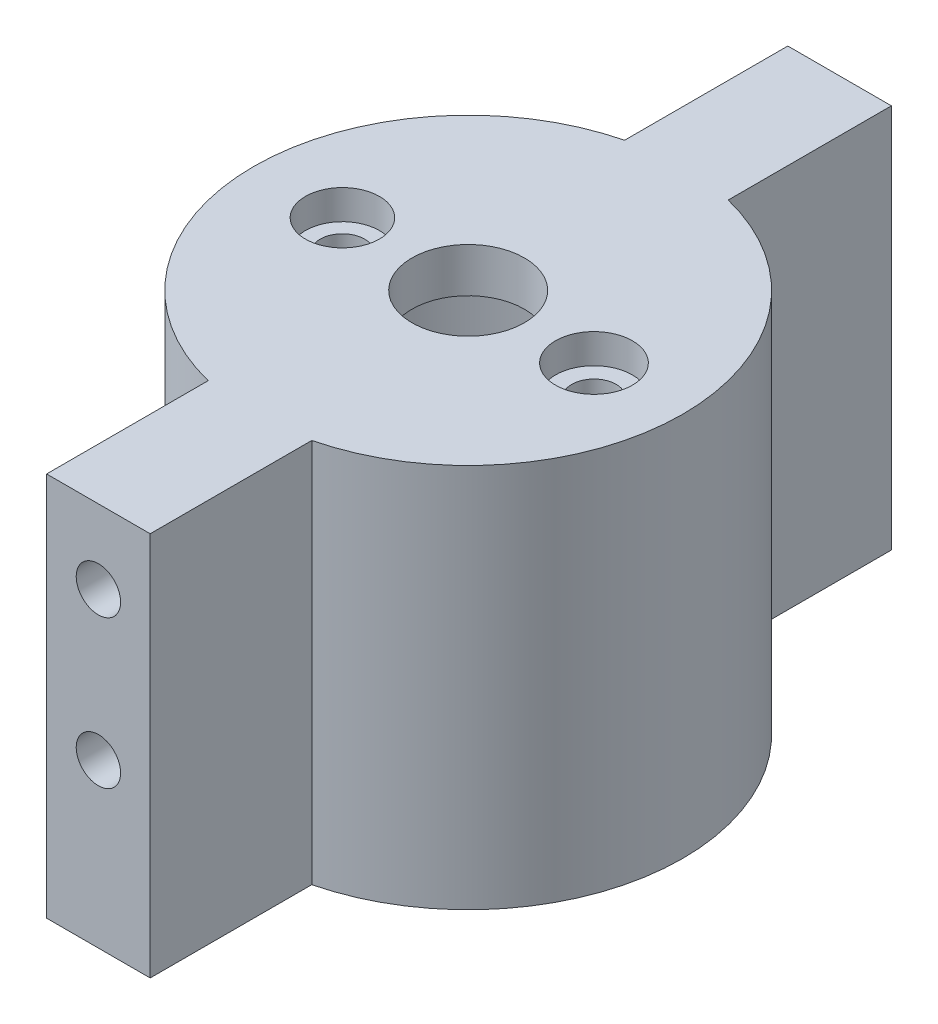
ISO-10303-21;
HEADER;
FILE_DESCRIPTION(('STEP AP214'),'2;1');
FILE_NAME('part.step','',(''),(''),'','','');
FILE_SCHEMA(('AUTOMOTIVE_DESIGN { 1 0 10303 214 1 1 1 1 }'));
ENDSEC;
DATA;
#1=APPLICATION_CONTEXT('core data for automotive mechanical design processes');
#2=APPLICATION_PROTOCOL_DEFINITION('international standard','automotive_design',2000,#1);
#3=PRODUCT_CONTEXT('',#1,'mechanical');
#4=PRODUCT('Part','Part','',(#3));
#5=PRODUCT_RELATED_PRODUCT_CATEGORY('part','',(#4));
#6=PRODUCT_DEFINITION_FORMATION('','',#4);
#7=PRODUCT_DEFINITION_CONTEXT('part definition',#1,'design');
#8=PRODUCT_DEFINITION('design','',#6,#7);
#9=PRODUCT_DEFINITION_SHAPE('','',#8);
#10=(LENGTH_UNIT() NAMED_UNIT(*) SI_UNIT(.MILLI.,.METRE.));
#11=(NAMED_UNIT(*) PLANE_ANGLE_UNIT() SI_UNIT($,.RADIAN.));
#12=(NAMED_UNIT(*) SI_UNIT($,.STERADIAN.) SOLID_ANGLE_UNIT());
#13=UNCERTAINTY_MEASURE_WITH_UNIT(LENGTH_MEASURE(1.E-05),#10,'distance_accuracy_value','');
#14=(GEOMETRIC_REPRESENTATION_CONTEXT(3) GLOBAL_UNCERTAINTY_ASSIGNED_CONTEXT((#13)) GLOBAL_UNIT_ASSIGNED_CONTEXT((#10,
#11,#12)) REPRESENTATION_CONTEXT('',''));
#15=CARTESIAN_POINT('',(0.,0.,0.));
#16=DIRECTION('',(0.,0.,1.));
#17=DIRECTION('',(1.,0.,0.));
#18=AXIS2_PLACEMENT_3D('',#15,#16,#17);
#19=CARTESIAN_POINT('',(0.,2.,0.));
#20=DIRECTION('',(0.,-1.,0.));
#21=DIRECTION('',(0.,0.,1.));
#22=AXIS2_PLACEMENT_3D('',#19,#20,#21);
#23=CYLINDRICAL_SURFACE('',#22,14.5);
#24=DIRECTION('',(0.,-1.,0.));
#25=VECTOR('',#24,1.);
#26=CARTESIAN_POINT('',(3.49999999999998,3.00000000000001,-14.0712472794703));
#27=LINE('',#26,#25);
#28=CARTESIAN_POINT('',(3.49999999999998,3.,-14.0712472794703));
#29=VERTEX_POINT('',#28);
#30=CARTESIAN_POINT('',(3.49999999999998,-23.,-14.0712472794703));
#31=VERTEX_POINT('',#30);
#32=EDGE_CURVE('E132',#29,#31,#27,.T.);
#33=ORIENTED_EDGE('',*,*,#32,.F.);
#34=CARTESIAN_POINT('',(0.,3.,0.));
#35=DIRECTION('',(0.,-1.,0.));
#36=DIRECTION('',(0.,0.,-1.));
#37=AXIS2_PLACEMENT_3D('',#34,#35,#36);
#38=CIRCLE('',#37,14.5);
#39=CARTESIAN_POINT('',(3.5,3.00000000000001,14.0712472794703));
#40=VERTEX_POINT('',#39);
#41=EDGE_CURVE('E138',#29,#40,#38,.T.);
#42=ORIENTED_EDGE('',*,*,#41,.T.);
#43=DIRECTION('',(0.,-1.,0.));
#44=VECTOR('',#43,1.);
#45=CARTESIAN_POINT('',(3.5,3.00000000000001,14.0712472794703));
#46=LINE('',#45,#44);
#47=CARTESIAN_POINT('',(3.5,-23.,14.0712472794703));
#48=VERTEX_POINT('',#47);
#49=EDGE_CURVE('E173',#40,#48,#46,.T.);
#50=ORIENTED_EDGE('',*,*,#49,.T.);
#51=CARTESIAN_POINT('',(0.,-23.,0.));
#52=DIRECTION('',(0.,1.,0.));
#53=DIRECTION('',(0.,0.,1.));
#54=AXIS2_PLACEMENT_3D('',#51,#52,#53);
#55=CIRCLE('',#54,14.5);
#56=EDGE_CURVE('E140',#48,#31,#55,.T.);
#57=ORIENTED_EDGE('',*,*,#56,.T.);
#58=EDGE_LOOP('',(#33,#42,#50,#57));
#59=FACE_BOUND('',#58,.T.);
#60=ADVANCED_FACE('F41',(#59),#23,.T.);
#61=CARTESIAN_POINT('',(-8.5,-0.5,0.));
#62=DIRECTION('',(0.,1.,0.));
#63=DIRECTION('',(0.,0.,-1.));
#64=AXIS2_PLACEMENT_3D('',#61,#62,#63);
#65=CYLINDRICAL_SURFACE('',#64,1.5);
#66=CARTESIAN_POINT('',(-8.5,0.,0.));
#67=DIRECTION('',(0.,-1.,0.));
#68=DIRECTION('',(0.,0.,-1.));
#69=AXIS2_PLACEMENT_3D('',#66,#67,#68);
#70=CIRCLE('',#69,1.5);
#71=CARTESIAN_POINT('',(-8.5,0.,-1.5));
#72=VERTEX_POINT('',#71);
#73=EDGE_CURVE('E50',#72,#72,#70,.T.);
#74=ORIENTED_EDGE('',*,*,#73,.T.);
#75=EDGE_LOOP('',(#74));
#76=FACE_BOUND('',#75,.T.);
#77=CARTESIAN_POINT('',(-8.5,1.,0.));
#78=DIRECTION('',(0.,-1.,0.));
#79=DIRECTION('',(0.,0.,-1.));
#80=AXIS2_PLACEMENT_3D('',#77,#78,#79);
#81=CIRCLE('',#80,1.5);
#82=CARTESIAN_POINT('',(-8.5,1.,-1.5));
#83=VERTEX_POINT('',#82);
#84=EDGE_CURVE('E45',#83,#83,#81,.F.);
#85=ORIENTED_EDGE('',*,*,#84,.T.);
#86=EDGE_LOOP('',(#85));
#87=FACE_BOUND('',#86,.T.);
#88=ADVANCED_FACE('F250',(#76,#87),#65,.F.);
#89=CARTESIAN_POINT('',(8.5,-0.5,0.));
#90=DIRECTION('',(0.,1.,0.));
#91=DIRECTION('',(0.,0.,-1.));
#92=AXIS2_PLACEMENT_3D('',#89,#90,#91);
#93=CYLINDRICAL_SURFACE('',#92,1.5);
#94=CARTESIAN_POINT('',(8.5,0.,0.));
#95=DIRECTION('',(0.,-1.,0.));
#96=DIRECTION('',(0.,0.,-1.));
#97=AXIS2_PLACEMENT_3D('',#94,#95,#96);
#98=CIRCLE('',#97,1.5);
#99=CARTESIAN_POINT('',(8.5,0.,-1.5));
#100=VERTEX_POINT('',#99);
#101=EDGE_CURVE('E11',#100,#100,#98,.T.);
#102=ORIENTED_EDGE('',*,*,#101,.T.);
#103=EDGE_LOOP('',(#102));
#104=FACE_BOUND('',#103,.T.);
#105=CARTESIAN_POINT('',(8.5,1.,0.));
#106=DIRECTION('',(0.,-1.,0.));
#107=DIRECTION('',(0.,0.,-1.));
#108=AXIS2_PLACEMENT_3D('',#105,#106,#107);
#109=CIRCLE('',#108,1.5);
#110=CARTESIAN_POINT('',(8.5,1.,-1.5));
#111=VERTEX_POINT('',#110);
#112=EDGE_CURVE('E158',#111,#111,#109,.F.);
#113=ORIENTED_EDGE('',*,*,#112,.T.);
#114=EDGE_LOOP('',(#113));
#115=FACE_BOUND('',#114,.T.);
#116=ADVANCED_FACE('F255',(#104,#115),#93,.F.);
#117=CARTESIAN_POINT('',(0.,0.,0.));
#118=DIRECTION('',(0.,1.,0.));
#119=DIRECTION('',(0.,0.,-1.));
#120=AXIS2_PLACEMENT_3D('',#117,#118,#119);
#121=PLANE('',#120);
#122=CARTESIAN_POINT('',(0.,0.,0.));
#123=DIRECTION('',(0.,-1.,0.));
#124=DIRECTION('',(0.,0.,-1.));
#125=AXIS2_PLACEMENT_3D('',#122,#123,#124);
#126=CIRCLE('',#125,3.8);
#127=CARTESIAN_POINT('',(0.,0.,-3.8));
#128=VERTEX_POINT('',#127);
#129=EDGE_CURVE('E154',#128,#128,#126,.T.);
#130=ORIENTED_EDGE('',*,*,#129,.F.);
#131=EDGE_LOOP('',(#130));
#132=FACE_BOUND('',#131,.T.);
#133=ORIENTED_EDGE('',*,*,#73,.F.);
#134=EDGE_LOOP('',(#133));
#135=FACE_BOUND('',#134,.T.);
#136=ORIENTED_EDGE('',*,*,#101,.F.);
#137=EDGE_LOOP('',(#136));
#138=FACE_BOUND('',#137,.T.);
#139=CARTESIAN_POINT('',(0.,0.,0.));
#140=DIRECTION('',(0.,1.,0.));
#141=DIRECTION('',(0.,0.,1.));
#142=AXIS2_PLACEMENT_3D('',#139,#140,#141);
#143=CIRCLE('',#142,12.5);
#144=CARTESIAN_POINT('',(0.,0.,12.5));
#145=VERTEX_POINT('',#144);
#146=EDGE_CURVE('E148',#145,#145,#143,.T.);
#147=ORIENTED_EDGE('',*,*,#146,.F.);
#148=EDGE_LOOP('',(#147));
#149=FACE_BOUND('',#148,.T.);
#150=ADVANCED_FACE('F261',(#132,#135,#138,#149),#121,.F.);
#151=CARTESIAN_POINT('',(-3.49999999999999,-23.,-14.0712472794703));
#152=VERTEX_POINT('',#151);
#153=CARTESIAN_POINT('',(-3.5,-23.,14.0712472794703));
#154=VERTEX_POINT('',#153);
#155=EDGE_CURVE('E137',#152,#154,#55,.T.);
#156=ORIENTED_EDGE('',*,*,#155,.T.);
#157=DIRECTION('',(0.,-1.,0.));
#158=VECTOR('',#157,1.);
#159=CARTESIAN_POINT('',(-3.5,3.00000000000001,14.0712472794703));
#160=LINE('',#159,#158);
#161=CARTESIAN_POINT('',(-3.5,3.,14.0712472794703));
#162=VERTEX_POINT('',#161);
#163=EDGE_CURVE('E136',#162,#154,#160,.T.);
#164=ORIENTED_EDGE('',*,*,#163,.F.);
#165=CARTESIAN_POINT('',(-3.49999999999999,3.00000000000001,-14.0712472794703));
#166=VERTEX_POINT('',#165);
#167=EDGE_CURVE('E118',#162,#166,#38,.T.);
#168=ORIENTED_EDGE('',*,*,#167,.T.);
#169=DIRECTION('',(0.,-1.,0.));
#170=VECTOR('',#169,1.);
#171=CARTESIAN_POINT('',(-3.49999999999999,3.00000000000001,-14.0712472794703));
#172=LINE('',#171,#170);
#173=EDGE_CURVE('E125',#166,#152,#172,.T.);
#174=ORIENTED_EDGE('',*,*,#173,.T.);
#175=EDGE_LOOP('',(#156,#164,#168,#174));
#176=FACE_BOUND('',#175,.T.);
#177=ADVANCED_FACE('F43',(#176),#23,.T.);
#178=CARTESIAN_POINT('',(0.,-0.5,0.));
#179=DIRECTION('',(0.,1.,0.));
#180=DIRECTION('',(0.,0.,-1.));
#181=AXIS2_PLACEMENT_3D('',#178,#179,#180);
#182=CYLINDRICAL_SURFACE('',#181,3.8);
#183=ORIENTED_EDGE('',*,*,#129,.T.);
#184=EDGE_LOOP('',(#183));
#185=FACE_BOUND('',#184,.T.);
#186=CARTESIAN_POINT('',(0.,3.,0.));
#187=DIRECTION('',(0.,-1.,0.));
#188=DIRECTION('',(0.,0.,-1.));
#189=AXIS2_PLACEMENT_3D('',#186,#187,#188);
#190=CIRCLE('',#189,3.8);
#191=CARTESIAN_POINT('',(0.,3.,-3.8));
#192=VERTEX_POINT('',#191);
#193=EDGE_CURVE('E143',#192,#192,#190,.T.);
#194=ORIENTED_EDGE('',*,*,#193,.F.);
#195=EDGE_LOOP('',(#194));
#196=FACE_BOUND('',#195,.T.);
#197=ADVANCED_FACE('F260',(#185,#196),#182,.F.);
#198=CARTESIAN_POINT('',(0.,-23.,0.));
#199=DIRECTION('',(0.,-1.,0.));
#200=DIRECTION('',(0.,0.,1.));
#201=AXIS2_PLACEMENT_3D('',#198,#199,#200);
#202=PLANE('',#201);
#203=DIRECTION('',(-1.,0.,0.));
#204=VECTOR('',#203,1.);
#205=CARTESIAN_POINT('',(3.5,-23.,24.99));
#206=LINE('',#205,#204);
#207=CARTESIAN_POINT('',(3.5,-23.,24.99));
#208=VERTEX_POINT('',#207);
#209=CARTESIAN_POINT('',(-3.49999999999999,-23.,24.99));
#210=VERTEX_POINT('',#209);
#211=EDGE_CURVE('E198',#208,#210,#206,.T.);
#212=ORIENTED_EDGE('',*,*,#211,.T.);
#213=DIRECTION('',(0.,0.,1.));
#214=VECTOR('',#213,1.);
#215=CARTESIAN_POINT('',(-3.5,-23.,25.1));
#216=LINE('',#215,#214);
#217=EDGE_CURVE('E189',#154,#210,#216,.T.);
#218=ORIENTED_EDGE('',*,*,#217,.F.);
#219=ORIENTED_EDGE('',*,*,#155,.F.);
#220=DIRECTION('',(0.,0.,1.));
#221=VECTOR('',#220,1.);
#222=CARTESIAN_POINT('',(-3.5,-23.,-25.1));
#223=LINE('',#222,#221);
#224=CARTESIAN_POINT('',(-3.5,-23.,-25.1));
#225=VERTEX_POINT('',#224);
#226=EDGE_CURVE('E128',#225,#152,#223,.T.);
#227=ORIENTED_EDGE('',*,*,#226,.F.);
#228=DIRECTION('',(-1.,0.,0.));
#229=VECTOR('',#228,1.);
#230=CARTESIAN_POINT('',(3.5,-23.,-25.1));
#231=LINE('',#230,#229);
#232=CARTESIAN_POINT('',(3.5,-23.,-25.1));
#233=VERTEX_POINT('',#232);
#234=EDGE_CURVE('E217',#233,#225,#231,.T.);
#235=ORIENTED_EDGE('',*,*,#234,.F.);
#236=DIRECTION('',(0.,0.,1.));
#237=VECTOR('',#236,1.);
#238=CARTESIAN_POINT('',(3.5,-23.,-25.1));
#239=LINE('',#238,#237);
#240=EDGE_CURVE('E221',#233,#31,#239,.T.);
#241=ORIENTED_EDGE('',*,*,#240,.T.);
#242=ORIENTED_EDGE('',*,*,#56,.F.);
#243=DIRECTION('',(0.,0.,-1.));
#244=VECTOR('',#243,1.);
#245=CARTESIAN_POINT('',(3.5,-23.,25.1));
#246=LINE('',#245,#244);
#247=EDGE_CURVE('E186',#208,#48,#246,.T.);
#248=ORIENTED_EDGE('',*,*,#247,.F.);
#249=EDGE_LOOP('',(#212,#218,#219,#227,#235,#241,#242,#248));
#250=FACE_BOUND('',#249,.T.);
#251=CARTESIAN_POINT('',(0.,-23.,0.));
#252=DIRECTION('',(0.,1.,0.));
#253=DIRECTION('',(0.,0.,1.));
#254=AXIS2_PLACEMENT_3D('',#251,#252,#253);
#255=CIRCLE('',#254,12.5);
#256=CARTESIAN_POINT('',(0.,-23.,12.5));
#257=VERTEX_POINT('',#256);
#258=EDGE_CURVE('E151',#257,#257,#255,.T.);
#259=ORIENTED_EDGE('',*,*,#258,.T.);
#260=EDGE_LOOP('',(#259));
#261=FACE_BOUND('',#260,.T.);
#262=ADVANCED_FACE('F266',(#250,#261),#202,.T.);
#263=CARTESIAN_POINT('',(0.,-23.,0.));
#264=DIRECTION('',(0.,1.,0.));
#265=DIRECTION('',(0.,0.,-1.));
#266=AXIS2_PLACEMENT_3D('',#263,#264,#265);
#267=CYLINDRICAL_SURFACE('',#266,12.5);
#268=ORIENTED_EDGE('',*,*,#258,.F.);
#269=EDGE_LOOP('',(#268));
#270=FACE_BOUND('',#269,.T.);
#271=ORIENTED_EDGE('',*,*,#146,.T.);
#272=EDGE_LOOP('',(#271));
#273=FACE_BOUND('',#272,.T.);
#274=ADVANCED_FACE('F280',(#270,#273),#267,.F.);
#275=CARTESIAN_POINT('',(0.,3.,0.));
#276=DIRECTION('',(0.,1.,0.));
#277=DIRECTION('',(0.,0.,-1.));
#278=AXIS2_PLACEMENT_3D('',#275,#276,#277);
#279=PLANE('',#278);
#280=DIRECTION('',(-1.,0.,0.));
#281=VECTOR('',#280,1.);
#282=CARTESIAN_POINT('',(3.5,3.00000000000001,24.99));
#283=LINE('',#282,#281);
#284=CARTESIAN_POINT('',(3.5,3.00000000000001,24.99));
#285=VERTEX_POINT('',#284);
#286=CARTESIAN_POINT('',(-3.49999999999999,3.00000000000001,24.99));
#287=VERTEX_POINT('',#286);
#288=EDGE_CURVE('E194',#285,#287,#283,.T.);
#289=ORIENTED_EDGE('',*,*,#288,.F.);
#290=DIRECTION('',(0.,0.,-1.));
#291=VECTOR('',#290,1.);
#292=CARTESIAN_POINT('',(3.5,3.00000000000001,25.1));
#293=LINE('',#292,#291);
#294=EDGE_CURVE('E184',#285,#40,#293,.T.);
#295=ORIENTED_EDGE('',*,*,#294,.T.);
#296=ORIENTED_EDGE('',*,*,#41,.F.);
#297=DIRECTION('',(0.,0.,1.));
#298=VECTOR('',#297,1.);
#299=CARTESIAN_POINT('',(3.5,3.00000000000001,-25.1));
#300=LINE('',#299,#298);
#301=CARTESIAN_POINT('',(3.5,3.00000000000001,-25.1));
#302=VERTEX_POINT('',#301);
#303=EDGE_CURVE('E58',#302,#29,#300,.T.);
#304=ORIENTED_EDGE('',*,*,#303,.F.);
#305=DIRECTION('',(-1.,0.,0.));
#306=VECTOR('',#305,1.);
#307=CARTESIAN_POINT('',(3.5,3.00000000000001,-25.1));
#308=LINE('',#307,#306);
#309=CARTESIAN_POINT('',(-3.5,3.00000000000001,-25.1));
#310=VERTEX_POINT('',#309);
#311=EDGE_CURVE('E121',#302,#310,#308,.T.);
#312=ORIENTED_EDGE('',*,*,#311,.T.);
#313=DIRECTION('',(0.,0.,1.));
#314=VECTOR('',#313,1.);
#315=CARTESIAN_POINT('',(-3.5,3.00000000000001,-25.1));
#316=LINE('',#315,#314);
#317=EDGE_CURVE('E111',#310,#166,#316,.T.);
#318=ORIENTED_EDGE('',*,*,#317,.T.);
#319=ORIENTED_EDGE('',*,*,#167,.F.);
#320=DIRECTION('',(0.,0.,1.));
#321=VECTOR('',#320,1.);
#322=CARTESIAN_POINT('',(-3.5,3.00000000000001,25.1));
#323=LINE('',#322,#321);
#324=EDGE_CURVE('E188',#162,#287,#323,.T.);
#325=ORIENTED_EDGE('',*,*,#324,.T.);
#326=EDGE_LOOP('',(#289,#295,#296,#304,#312,#318,#319,#325));
#327=FACE_BOUND('',#326,.T.);
#328=CARTESIAN_POINT('',(8.5,3.,0.));
#329=DIRECTION('',(0.,-1.,0.));
#330=DIRECTION('',(0.,0.,-1.));
#331=AXIS2_PLACEMENT_3D('',#328,#329,#330);
#332=CIRCLE('',#331,2.6);
#333=CARTESIAN_POINT('',(8.5,3.,-2.6));
#334=VERTEX_POINT('',#333);
#335=EDGE_CURVE('E165',#334,#334,#332,.T.);
#336=ORIENTED_EDGE('',*,*,#335,.T.);
#337=EDGE_LOOP('',(#336));
#338=FACE_BOUND('',#337,.T.);
#339=CARTESIAN_POINT('',(-8.5,3.,0.));
#340=DIRECTION('',(0.,-1.,0.));
#341=DIRECTION('',(0.,0.,-1.));
#342=AXIS2_PLACEMENT_3D('',#339,#340,#341);
#343=CIRCLE('',#342,2.5);
#344=CARTESIAN_POINT('',(-8.5,3.,-2.5));
#345=VERTEX_POINT('',#344);
#346=EDGE_CURVE('E170',#345,#345,#343,.T.);
#347=ORIENTED_EDGE('',*,*,#346,.T.);
#348=EDGE_LOOP('',(#347));
#349=FACE_BOUND('',#348,.T.);
#350=ORIENTED_EDGE('',*,*,#193,.T.);
#351=EDGE_LOOP('',(#350));
#352=FACE_BOUND('',#351,.T.);
#353=ADVANCED_FACE('F114',(#327,#338,#349,#352),#279,.T.);
#354=CARTESIAN_POINT('',(-8.5,1.,0.));
#355=DIRECTION('',(0.,1.,0.));
#356=DIRECTION('',(0.,0.,-1.));
#357=AXIS2_PLACEMENT_3D('',#354,#355,#356);
#358=PLANE('',#357);
#359=CARTESIAN_POINT('',(-8.5,1.,0.));
#360=DIRECTION('',(0.,-1.,0.));
#361=DIRECTION('',(0.,0.,-1.));
#362=AXIS2_PLACEMENT_3D('',#359,#360,#361);
#363=CIRCLE('',#362,2.5);
#364=CARTESIAN_POINT('',(-8.5,1.,-2.5));
#365=VERTEX_POINT('',#364);
#366=EDGE_CURVE('E177',#365,#365,#363,.T.);
#367=ORIENTED_EDGE('',*,*,#366,.F.);
#368=EDGE_LOOP('',(#367));
#369=FACE_BOUND('',#368,.T.);
#370=ORIENTED_EDGE('',*,*,#84,.F.);
#371=EDGE_LOOP('',(#370));
#372=FACE_BOUND('',#371,.T.);
#373=ADVANCED_FACE('F287',(#369,#372),#358,.T.);
#374=CARTESIAN_POINT('',(-8.5,1.,0.));
#375=DIRECTION('',(0.,1.,0.));
#376=DIRECTION('',(0.,0.,-1.));
#377=AXIS2_PLACEMENT_3D('',#374,#375,#376);
#378=CYLINDRICAL_SURFACE('',#377,2.5);
#379=ORIENTED_EDGE('',*,*,#366,.T.);
#380=EDGE_LOOP('',(#379));
#381=FACE_BOUND('',#380,.T.);
#382=ORIENTED_EDGE('',*,*,#346,.F.);
#383=EDGE_LOOP('',(#382));
#384=FACE_BOUND('',#383,.T.);
#385=ADVANCED_FACE('F290',(#381,#384),#378,.F.);
#386=CARTESIAN_POINT('',(8.5,1.,0.));
#387=DIRECTION('',(0.,1.,0.));
#388=DIRECTION('',(0.,0.,-1.));
#389=AXIS2_PLACEMENT_3D('',#386,#387,#388);
#390=PLANE('',#389);
#391=CARTESIAN_POINT('',(8.5,1.,0.));
#392=DIRECTION('',(0.,-1.,0.));
#393=DIRECTION('',(0.,0.,-1.));
#394=AXIS2_PLACEMENT_3D('',#391,#392,#393);
#395=CIRCLE('',#394,2.6);
#396=CARTESIAN_POINT('',(8.5,1.,-2.6));
#397=VERTEX_POINT('',#396);
#398=EDGE_CURVE('E160',#397,#397,#395,.T.);
#399=ORIENTED_EDGE('',*,*,#398,.F.);
#400=EDGE_LOOP('',(#399));
#401=FACE_BOUND('',#400,.T.);
#402=ORIENTED_EDGE('',*,*,#112,.F.);
#403=EDGE_LOOP('',(#402));
#404=FACE_BOUND('',#403,.T.);
#405=ADVANCED_FACE('F294',(#401,#404),#390,.T.);
#406=CARTESIAN_POINT('',(8.5,1.,0.));
#407=DIRECTION('',(0.,1.,0.));
#408=DIRECTION('',(0.,0.,-1.));
#409=AXIS2_PLACEMENT_3D('',#406,#407,#408);
#410=CYLINDRICAL_SURFACE('',#409,2.6);
#411=ORIENTED_EDGE('',*,*,#398,.T.);
#412=EDGE_LOOP('',(#411));
#413=FACE_BOUND('',#412,.T.);
#414=ORIENTED_EDGE('',*,*,#335,.F.);
#415=EDGE_LOOP('',(#414));
#416=FACE_BOUND('',#415,.T.);
#417=ADVANCED_FACE('F295',(#413,#416),#410,.F.);
#418=CARTESIAN_POINT('',(-3.5,3.00000000000001,25.1));
#419=DIRECTION('',(-1.,0.,0.));
#420=DIRECTION('',(0.,0.,-1.));
#421=AXIS2_PLACEMENT_3D('',#418,#419,#420);
#422=PLANE('',#421);
#423=DIRECTION('',(0.,-1.,0.));
#424=VECTOR('',#423,1.);
#425=CARTESIAN_POINT('',(-3.49999999999999,3.00000000000001,24.99));
#426=LINE('',#425,#424);
#427=EDGE_CURVE('E196',#287,#210,#426,.T.);
#428=ORIENTED_EDGE('',*,*,#427,.F.);
#429=ORIENTED_EDGE('',*,*,#324,.F.);
#430=ORIENTED_EDGE('',*,*,#163,.T.);
#431=ORIENTED_EDGE('',*,*,#217,.T.);
#432=EDGE_LOOP('',(#428,#429,#430,#431));
#433=FACE_BOUND('',#432,.T.);
#434=ADVANCED_FACE('F298',(#433),#422,.T.);
#435=CARTESIAN_POINT('',(3.5,3.00000000000001,25.1));
#436=DIRECTION('',(1.,0.,0.));
#437=DIRECTION('',(0.,0.,1.));
#438=AXIS2_PLACEMENT_3D('',#435,#436,#437);
#439=PLANE('',#438);
#440=DIRECTION('',(0.,-1.,0.));
#441=VECTOR('',#440,1.);
#442=CARTESIAN_POINT('',(3.5,3.00000000000001,24.99));
#443=LINE('',#442,#441);
#444=EDGE_CURVE('E66',#285,#208,#443,.T.);
#445=ORIENTED_EDGE('',*,*,#444,.T.);
#446=ORIENTED_EDGE('',*,*,#247,.T.);
#447=ORIENTED_EDGE('',*,*,#49,.F.);
#448=ORIENTED_EDGE('',*,*,#294,.F.);
#449=EDGE_LOOP('',(#445,#446,#447,#448));
#450=FACE_BOUND('',#449,.T.);
#451=ADVANCED_FACE('F304',(#450),#439,.T.);
#452=CARTESIAN_POINT('',(0.,0.,24.99));
#453=DIRECTION('',(0.,0.,-1.));
#454=DIRECTION('',(1.,0.,0.));
#455=AXIS2_PLACEMENT_3D('',#452,#453,#454);
#456=PLANE('',#455);
#457=CARTESIAN_POINT('',(0.,-1.99999999999999,24.99));
#458=DIRECTION('',(0.,0.,-1.));
#459=DIRECTION('',(-1.,0.,0.));
#460=AXIS2_PLACEMENT_3D('',#457,#458,#459);
#461=CIRCLE('',#460,1.5);
#462=CARTESIAN_POINT('',(-1.5,-1.99999999999999,24.99));
#463=VERTEX_POINT('',#462);
#464=EDGE_CURVE('E208',#463,#463,#461,.T.);
#465=ORIENTED_EDGE('',*,*,#464,.T.);
#466=EDGE_LOOP('',(#465));
#467=FACE_BOUND('',#466,.T.);
#468=CARTESIAN_POINT('',(0.,-12.,24.99));
#469=DIRECTION('',(0.,0.,-1.));
#470=DIRECTION('',(-1.,0.,0.));
#471=AXIS2_PLACEMENT_3D('',#468,#469,#470);
#472=CIRCLE('',#471,1.5);
#473=CARTESIAN_POINT('',(-1.5,-12.,24.99));
#474=VERTEX_POINT('',#473);
#475=EDGE_CURVE('E205',#474,#474,#472,.T.);
#476=ORIENTED_EDGE('',*,*,#475,.T.);
#477=EDGE_LOOP('',(#476));
#478=FACE_BOUND('',#477,.T.);
#479=ORIENTED_EDGE('',*,*,#211,.F.);
#480=ORIENTED_EDGE('',*,*,#444,.F.);
#481=ORIENTED_EDGE('',*,*,#288,.T.);
#482=ORIENTED_EDGE('',*,*,#427,.T.);
#483=EDGE_LOOP('',(#479,#480,#481,#482));
#484=FACE_BOUND('',#483,.T.);
#485=ADVANCED_FACE('F307',(#467,#478,#484),#456,.F.);
#486=CARTESIAN_POINT('',(0.,-12.,18.99));
#487=DIRECTION('',(0.,0.,1.));
#488=DIRECTION('',(-1.,0.,0.));
#489=AXIS2_PLACEMENT_3D('',#486,#487,#488);
#490=CYLINDRICAL_SURFACE('',#489,1.5);
#491=CARTESIAN_POINT('',(0.,-12.,18.99));
#492=DIRECTION('',(0.,0.,-1.));
#493=DIRECTION('',(-1.,0.,0.));
#494=AXIS2_PLACEMENT_3D('',#491,#492,#493);
#495=CIRCLE('',#494,1.5);
#496=CARTESIAN_POINT('',(-1.5,-12.,18.99));
#497=VERTEX_POINT('',#496);
#498=EDGE_CURVE('E202',#497,#497,#495,.T.);
#499=ORIENTED_EDGE('',*,*,#498,.T.);
#500=EDGE_LOOP('',(#499));
#501=FACE_BOUND('',#500,.T.);
#502=ORIENTED_EDGE('',*,*,#475,.F.);
#503=EDGE_LOOP('',(#502));
#504=FACE_BOUND('',#503,.T.);
#505=ADVANCED_FACE('F311',(#501,#504),#490,.F.);
#506=CARTESIAN_POINT('',(0.,-12.,18.99));
#507=DIRECTION('',(0.,0.,1.));
#508=DIRECTION('',(-1.,0.,0.));
#509=AXIS2_PLACEMENT_3D('',#506,#507,#508);
#510=PLANE('',#509);
#511=ORIENTED_EDGE('',*,*,#498,.F.);
#512=EDGE_LOOP('',(#511));
#513=FACE_BOUND('',#512,.T.);
#514=ADVANCED_FACE('F313',(#513),#510,.T.);
#515=CARTESIAN_POINT('',(0.,-1.99999999999999,18.99));
#516=DIRECTION('',(0.,0.,1.));
#517=DIRECTION('',(-1.,0.,0.));
#518=AXIS2_PLACEMENT_3D('',#515,#516,#517);
#519=CYLINDRICAL_SURFACE('',#518,1.5);
#520=CARTESIAN_POINT('',(0.,-1.99999999999999,18.99));
#521=DIRECTION('',(0.,0.,-1.));
#522=DIRECTION('',(-1.,0.,0.));
#523=AXIS2_PLACEMENT_3D('',#520,#521,#522);
#524=CIRCLE('',#523,1.5);
#525=CARTESIAN_POINT('',(-1.5,-1.99999999999999,18.99));
#526=VERTEX_POINT('',#525);
#527=EDGE_CURVE('E201',#526,#526,#524,.T.);
#528=ORIENTED_EDGE('',*,*,#527,.T.);
#529=EDGE_LOOP('',(#528));
#530=FACE_BOUND('',#529,.T.);
#531=ORIENTED_EDGE('',*,*,#464,.F.);
#532=EDGE_LOOP('',(#531));
#533=FACE_BOUND('',#532,.T.);
#534=ADVANCED_FACE('F316',(#530,#533),#519,.F.);
#535=CARTESIAN_POINT('',(0.,-1.99999999999999,18.99));
#536=DIRECTION('',(0.,0.,1.));
#537=DIRECTION('',(-1.,0.,0.));
#538=AXIS2_PLACEMENT_3D('',#535,#536,#537);
#539=PLANE('',#538);
#540=ORIENTED_EDGE('',*,*,#527,.F.);
#541=EDGE_LOOP('',(#540));
#542=FACE_BOUND('',#541,.T.);
#543=ADVANCED_FACE('F323',(#542),#539,.T.);
#544=CARTESIAN_POINT('',(3.5,3.00000000000001,-25.1));
#545=DIRECTION('',(-1.,0.,0.));
#546=DIRECTION('',(0.,0.,-1.));
#547=AXIS2_PLACEMENT_3D('',#544,#545,#546);
#548=PLANE('',#547);
#549=ORIENTED_EDGE('',*,*,#240,.F.);
#550=DIRECTION('',(0.,-1.,0.));
#551=VECTOR('',#550,1.);
#552=CARTESIAN_POINT('',(3.5,3.00000000000001,-25.1));
#553=LINE('',#552,#551);
#554=EDGE_CURVE('E215',#302,#233,#553,.T.);
#555=ORIENTED_EDGE('',*,*,#554,.F.);
#556=ORIENTED_EDGE('',*,*,#303,.T.);
#557=ORIENTED_EDGE('',*,*,#32,.T.);
#558=EDGE_LOOP('',(#549,#555,#556,#557));
#559=FACE_BOUND('',#558,.T.);
#560=ADVANCED_FACE('F327',(#559),#548,.F.);
#561=CARTESIAN_POINT('',(-3.5,3.00000000000001,-25.1));
#562=DIRECTION('',(-1.,0.,0.));
#563=DIRECTION('',(0.,0.,-1.));
#564=AXIS2_PLACEMENT_3D('',#561,#562,#563);
#565=PLANE('',#564);
#566=ORIENTED_EDGE('',*,*,#226,.T.);
#567=ORIENTED_EDGE('',*,*,#173,.F.);
#568=ORIENTED_EDGE('',*,*,#317,.F.);
#569=DIRECTION('',(0.,-1.,0.));
#570=VECTOR('',#569,1.);
#571=CARTESIAN_POINT('',(-3.5,3.00000000000001,-25.1));
#572=LINE('',#571,#570);
#573=EDGE_CURVE('E133',#310,#225,#572,.T.);
#574=ORIENTED_EDGE('',*,*,#573,.T.);
#575=EDGE_LOOP('',(#566,#567,#568,#574));
#576=FACE_BOUND('',#575,.T.);
#577=ADVANCED_FACE('F126',(#576),#565,.T.);
#578=CARTESIAN_POINT('',(3.5,3.00000000000001,-25.1));
#579=DIRECTION('',(0.,0.,-1.));
#580=DIRECTION('',(1.,0.,0.));
#581=AXIS2_PLACEMENT_3D('',#578,#579,#580);
#582=PLANE('',#581);
#583=CARTESIAN_POINT('',(0.,-1.99999999999999,-25.1));
#584=DIRECTION('',(0.,0.,1.));
#585=DIRECTION('',(1.,0.,0.));
#586=AXIS2_PLACEMENT_3D('',#583,#584,#585);
#587=CIRCLE('',#586,1.5);
#588=CARTESIAN_POINT('',(1.5,-1.99999999999999,-25.1));
#589=VERTEX_POINT('',#588);
#590=EDGE_CURVE('E232',#589,#589,#587,.T.);
#591=ORIENTED_EDGE('',*,*,#590,.T.);
#592=EDGE_LOOP('',(#591));
#593=FACE_BOUND('',#592,.T.);
#594=CARTESIAN_POINT('',(0.,-12.,-25.1));
#595=DIRECTION('',(0.,0.,1.));
#596=DIRECTION('',(1.,0.,0.));
#597=AXIS2_PLACEMENT_3D('',#594,#595,#596);
#598=CIRCLE('',#597,1.5);
#599=CARTESIAN_POINT('',(1.5,-12.,-25.1));
#600=VERTEX_POINT('',#599);
#601=EDGE_CURVE('E229',#600,#600,#598,.T.);
#602=ORIENTED_EDGE('',*,*,#601,.T.);
#603=EDGE_LOOP('',(#602));
#604=FACE_BOUND('',#603,.T.);
#605=ORIENTED_EDGE('',*,*,#234,.T.);
#606=ORIENTED_EDGE('',*,*,#573,.F.);
#607=ORIENTED_EDGE('',*,*,#311,.F.);
#608=ORIENTED_EDGE('',*,*,#554,.T.);
#609=EDGE_LOOP('',(#605,#606,#607,#608));
#610=FACE_BOUND('',#609,.T.);
#611=ADVANCED_FACE('F333',(#593,#604,#610),#582,.T.);
#612=CARTESIAN_POINT('',(0.,-12.,-20.1));
#613=DIRECTION('',(0.,0.,-1.));
#614=DIRECTION('',(1.,0.,0.));
#615=AXIS2_PLACEMENT_3D('',#612,#613,#614);
#616=CYLINDRICAL_SURFACE('',#615,1.5);
#617=CARTESIAN_POINT('',(0.,-12.,-20.1));
#618=DIRECTION('',(0.,0.,1.));
#619=DIRECTION('',(1.,0.,0.));
#620=AXIS2_PLACEMENT_3D('',#617,#618,#619);
#621=CIRCLE('',#620,1.5);
#622=CARTESIAN_POINT('',(1.5,-12.,-20.1));
#623=VERTEX_POINT('',#622);
#624=EDGE_CURVE('E226',#623,#623,#621,.T.);
#625=ORIENTED_EDGE('',*,*,#624,.T.);
#626=EDGE_LOOP('',(#625));
#627=FACE_BOUND('',#626,.T.);
#628=ORIENTED_EDGE('',*,*,#601,.F.);
#629=EDGE_LOOP('',(#628));
#630=FACE_BOUND('',#629,.T.);
#631=ADVANCED_FACE('F336',(#627,#630),#616,.F.);
#632=CARTESIAN_POINT('',(0.,-12.,-20.1));
#633=DIRECTION('',(0.,0.,-1.));
#634=DIRECTION('',(1.,0.,0.));
#635=AXIS2_PLACEMENT_3D('',#632,#633,#634);
#636=PLANE('',#635);
#637=ORIENTED_EDGE('',*,*,#624,.F.);
#638=EDGE_LOOP('',(#637));
#639=FACE_BOUND('',#638,.T.);
#640=ADVANCED_FACE('F247',(#639),#636,.T.);
#641=CARTESIAN_POINT('',(0.,-1.99999999999999,-20.1));
#642=DIRECTION('',(0.,0.,-1.));
#643=DIRECTION('',(1.,0.,0.));
#644=AXIS2_PLACEMENT_3D('',#641,#642,#643);
#645=CYLINDRICAL_SURFACE('',#644,1.5);
#646=CARTESIAN_POINT('',(0.,-1.99999999999999,-20.1));
#647=DIRECTION('',(0.,0.,1.));
#648=DIRECTION('',(1.,0.,0.));
#649=AXIS2_PLACEMENT_3D('',#646,#647,#648);
#650=CIRCLE('',#649,1.5);
#651=CARTESIAN_POINT('',(1.5,-1.99999999999999,-20.1));
#652=VERTEX_POINT('',#651);
#653=EDGE_CURVE('E223',#652,#652,#650,.T.);
#654=ORIENTED_EDGE('',*,*,#653,.T.);
#655=EDGE_LOOP('',(#654));
#656=FACE_BOUND('',#655,.T.);
#657=ORIENTED_EDGE('',*,*,#590,.F.);
#658=EDGE_LOOP('',(#657));
#659=FACE_BOUND('',#658,.T.);
#660=ADVANCED_FACE('F238',(#656,#659),#645,.F.);
#661=CARTESIAN_POINT('',(0.,-1.99999999999999,-20.1));
#662=DIRECTION('',(0.,0.,-1.));
#663=DIRECTION('',(1.,0.,0.));
#664=AXIS2_PLACEMENT_3D('',#661,#662,#663);
#665=PLANE('',#664);
#666=ORIENTED_EDGE('',*,*,#653,.F.);
#667=EDGE_LOOP('',(#666));
#668=FACE_BOUND('',#667,.T.);
#669=ADVANCED_FACE('F241',(#668),#665,.T.);
#670=CLOSED_SHELL('',(#60,#88,#116,#150,#177,#197,#262,#274,#353,#373,#385,#405,#417,#434,#451,
#485,#505,#514,#534,#543,#560,#577,#611,#631,#640,#660,#669));
#671=MANIFOLD_SOLID_BREP('B2',#670);
#672=ADVANCED_BREP_SHAPE_REPRESENTATION('',(#18,#671),#14);
#673=SHAPE_DEFINITION_REPRESENTATION(#9,#672);
ENDSEC;
END-ISO-10303-21;
